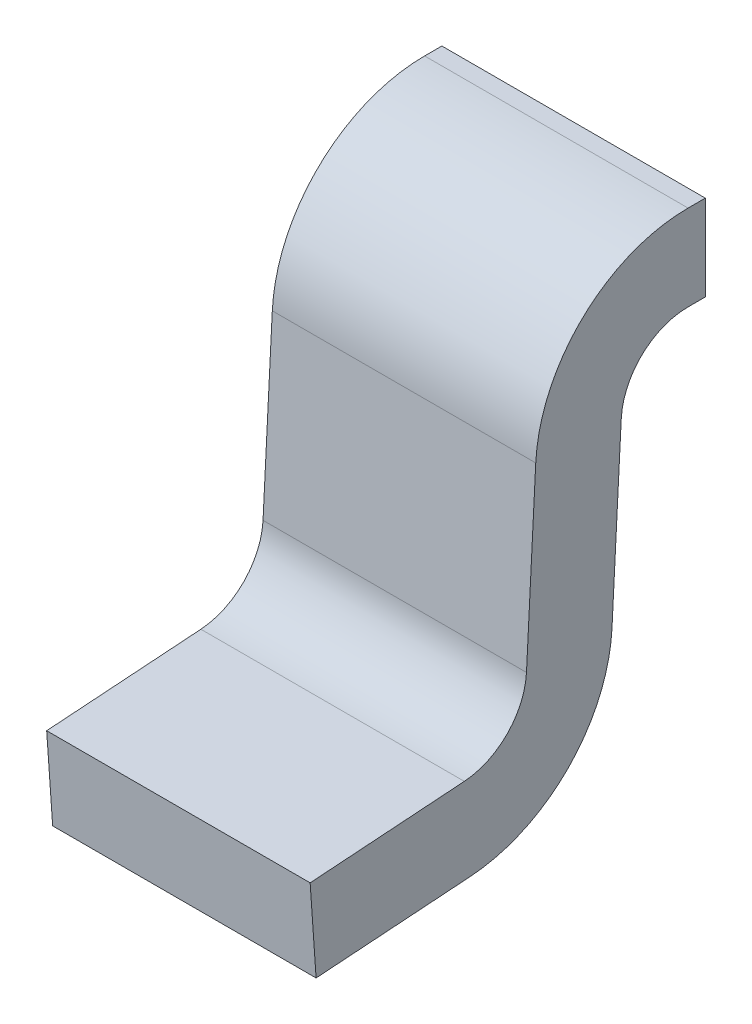
ISO-10303-21;
HEADER;
FILE_DESCRIPTION(('STEP AP214'),'2;1');
FILE_NAME('part.step','',(''),(''),'','','');
FILE_SCHEMA(('AUTOMOTIVE_DESIGN { 1 0 10303 214 1 1 1 1 }'));
ENDSEC;
DATA;
#1=APPLICATION_CONTEXT('core data for automotive mechanical design processes');
#2=APPLICATION_PROTOCOL_DEFINITION('international standard','automotive_design',2000,#1);
#3=PRODUCT_CONTEXT('',#1,'mechanical');
#4=PRODUCT('Part','Part','',(#3));
#5=PRODUCT_RELATED_PRODUCT_CATEGORY('part','',(#4));
#6=PRODUCT_DEFINITION_FORMATION('','',#4);
#7=PRODUCT_DEFINITION_CONTEXT('part definition',#1,'design');
#8=PRODUCT_DEFINITION('design','',#6,#7);
#9=PRODUCT_DEFINITION_SHAPE('','',#8);
#10=(LENGTH_UNIT() NAMED_UNIT(*) SI_UNIT(.MILLI.,.METRE.));
#11=(NAMED_UNIT(*) PLANE_ANGLE_UNIT() SI_UNIT($,.RADIAN.));
#12=(NAMED_UNIT(*) SI_UNIT($,.STERADIAN.) SOLID_ANGLE_UNIT());
#13=UNCERTAINTY_MEASURE_WITH_UNIT(LENGTH_MEASURE(1.E-05),#10,'distance_accuracy_value','');
#14=(GEOMETRIC_REPRESENTATION_CONTEXT(3) GLOBAL_UNCERTAINTY_ASSIGNED_CONTEXT((#13)) GLOBAL_UNIT_ASSIGNED_CONTEXT((#10,
#11,#12)) REPRESENTATION_CONTEXT('',''));
#15=CARTESIAN_POINT('',(0.,0.,0.));
#16=DIRECTION('',(0.,0.,1.));
#17=DIRECTION('',(1.,0.,0.));
#18=AXIS2_PLACEMENT_3D('',#15,#16,#17);
#19=CARTESIAN_POINT('',(-0.2,-0.219336739934,0.01149495145513));
#20=DIRECTION('',(0.,-0.0523359562429177,-0.998629534754575));
#21=DIRECTION('',(0.,0.998629534754575,-0.0523359562429177));
#22=AXIS2_PLACEMENT_3D('',#19,#20,#21);
#23=PLANE('',#22);
#24=DIRECTION('',(1.,0.,0.));
#25=VECTOR('',#24,1.);
#26=CARTESIAN_POINT('',(-0.2,0.253717333154016,-0.0132967619959213));
#27=LINE('',#26,#25);
#28=CARTESIAN_POINT('',(-0.2,0.253717333154144,-0.0132967619960828));
#29=VERTEX_POINT('',#28);
#30=CARTESIAN_POINT('',(0.2,0.253717333154144,-0.0132967619960828));
#31=VERTEX_POINT('',#30);
#32=EDGE_CURVE('E157',#29,#31,#27,.T.);
#33=ORIENTED_EDGE('',*,*,#32,.T.);
#34=DIRECTION('',(0.,0.998629534754571,-0.0523359562429933));
#35=VECTOR('',#34,1.);
#36=CARTESIAN_POINT('',(0.2,-0.0147151802415,0.0007711899182067));
#37=LINE('',#36,#35);
#38=CARTESIAN_POINT('',(0.2,-0.0147151802415051,0.000771189918023985));
#39=VERTEX_POINT('',#38);
#40=EDGE_CURVE('E181',#39,#31,#37,.T.);
#41=ORIENTED_EDGE('',*,*,#40,.F.);
#42=DIRECTION('',(-1.,0.,0.));
#43=VECTOR('',#42,1.);
#44=CARTESIAN_POINT('',(-0.2,-0.0147151802415191,0.000771189917841758));
#45=LINE('',#44,#43);
#46=CARTESIAN_POINT('',(-0.2,-0.0147151802415051,0.000771189918023985));
#47=VERTEX_POINT('',#46);
#48=EDGE_CURVE('E116',#47,#39,#45,.F.);
#49=ORIENTED_EDGE('',*,*,#48,.F.);
#50=DIRECTION('',(0.,0.998629534754571,-0.0523359562429933));
#51=VECTOR('',#50,1.);
#52=CARTESIAN_POINT('',(-0.2,-0.0147151802415,0.0007711899182067));
#53=LINE('',#52,#51);
#54=EDGE_CURVE('E139',#47,#29,#53,.T.);
#55=ORIENTED_EDGE('',*,*,#54,.T.);
#56=EDGE_LOOP('',(#33,#41,#49,#55));
#57=FACE_BOUND('',#56,.T.);
#58=ADVANCED_FACE('F17',(#57),#23,.T.);
#59=CARTESIAN_POINT('',(-0.2,0.2484,-0.114757522727));
#60=DIRECTION('',(1.,0.,0.));
#61=DIRECTION('',(0.,0.,-1.));
#62=AXIS2_PLACEMENT_3D('',#59,#60,#61);
#63=CYLINDRICAL_SURFACE('',#62,0.1016);
#64=ORIENTED_EDGE('',*,*,#32,.F.);
#65=CARTESIAN_POINT('',(-0.2,0.2484,-0.114757522727));
#66=DIRECTION('',(1.,0.,0.));
#67=DIRECTION('',(0.,0.,-1.));
#68=AXIS2_PLACEMENT_3D('',#65,#66,#67);
#69=CIRCLE('',#68,0.1016);
#70=CARTESIAN_POINT('',(-0.2,0.35,-0.114757522727));
#71=VERTEX_POINT('',#70);
#72=EDGE_CURVE('E177',#29,#71,#69,.F.);
#73=ORIENTED_EDGE('',*,*,#72,.T.);
#74=DIRECTION('',(1.,0.,0.));
#75=VECTOR('',#74,1.);
#76=CARTESIAN_POINT('',(-0.2,0.35,-0.114757522727));
#77=LINE('',#76,#75);
#78=CARTESIAN_POINT('',(0.2,0.35,-0.114757522727));
#79=VERTEX_POINT('',#78);
#80=EDGE_CURVE('E152',#79,#71,#77,.F.);
#81=ORIENTED_EDGE('',*,*,#80,.F.);
#82=CARTESIAN_POINT('',(0.2,0.2484,-0.114757522727));
#83=DIRECTION('',(1.,0.,0.));
#84=DIRECTION('',(0.,0.,-1.));
#85=AXIS2_PLACEMENT_3D('',#82,#83,#84);
#86=CIRCLE('',#85,0.1016);
#87=EDGE_CURVE('E179',#31,#79,#86,.F.);
#88=ORIENTED_EDGE('',*,*,#87,.F.);
#89=EDGE_LOOP('',(#64,#73,#81,#88));
#90=FACE_BOUND('',#89,.T.);
#91=ADVANCED_FACE('F222',(#90),#63,.F.);
#92=CARTESIAN_POINT('',(-0.2,0.35,-0.01834272274906));
#93=DIRECTION('',(0.,-1.,0.));
#94=DIRECTION('',(0.,0.,-1.));
#95=AXIS2_PLACEMENT_3D('',#92,#93,#94);
#96=PLANE('',#95);
#97=ORIENTED_EDGE('',*,*,#80,.T.);
#98=DIRECTION('',(0.,0.,-1.));
#99=VECTOR('',#98,1.);
#100=CARTESIAN_POINT('',(-0.2,0.35,0.));
#101=LINE('',#100,#99);
#102=CARTESIAN_POINT('',(-0.2,0.35,-0.140931658413));
#103=VERTEX_POINT('',#102);
#104=EDGE_CURVE('E147',#71,#103,#101,.T.);
#105=ORIENTED_EDGE('',*,*,#104,.T.);
#106=DIRECTION('',(-1.,0.,0.));
#107=VECTOR('',#106,1.);
#108=CARTESIAN_POINT('',(-0.2,0.35,-0.140931658413));
#109=LINE('',#108,#107);
#110=CARTESIAN_POINT('',(0.2,0.35,-0.140931658413));
#111=VERTEX_POINT('',#110);
#112=EDGE_CURVE('E132',#111,#103,#109,.T.);
#113=ORIENTED_EDGE('',*,*,#112,.F.);
#114=DIRECTION('',(0.,0.,-1.));
#115=VECTOR('',#114,1.);
#116=CARTESIAN_POINT('',(0.2,0.35,0.));
#117=LINE('',#116,#115);
#118=EDGE_CURVE('E162',#79,#111,#117,.T.);
#119=ORIENTED_EDGE('',*,*,#118,.F.);
#120=EDGE_LOOP('',(#97,#105,#113,#119));
#121=FACE_BOUND('',#120,.T.);
#122=ADVANCED_FACE('F228',(#121),#96,.T.);
#123=CARTESIAN_POINT('',(-0.2,0.35,-0.140931658413));
#124=DIRECTION('',(0.,0.,-1.));
#125=DIRECTION('',(-1.,0.,0.));
#126=AXIS2_PLACEMENT_3D('',#123,#124,#125);
#127=PLANE('',#126);
#128=ORIENTED_EDGE('',*,*,#112,.T.);
#129=DIRECTION('',(0.,1.,0.));
#130=VECTOR('',#129,1.);
#131=CARTESIAN_POINT('',(-0.2,0.,-0.140931658413));
#132=LINE('',#131,#130);
#133=CARTESIAN_POINT('',(-0.2,0.48,-0.140931658413));
#134=VERTEX_POINT('',#133);
#135=EDGE_CURVE('E143',#103,#134,#132,.T.);
#136=ORIENTED_EDGE('',*,*,#135,.T.);
#137=DIRECTION('',(1.,0.,0.));
#138=VECTOR('',#137,1.);
#139=CARTESIAN_POINT('',(-0.2,0.48,-0.140931658413));
#140=LINE('',#139,#138);
#141=CARTESIAN_POINT('',(0.2,0.48,-0.140931658413));
#142=VERTEX_POINT('',#141);
#143=EDGE_CURVE('E136',#142,#134,#140,.F.);
#144=ORIENTED_EDGE('',*,*,#143,.F.);
#145=DIRECTION('',(0.,1.,0.));
#146=VECTOR('',#145,1.);
#147=CARTESIAN_POINT('',(0.2,0.,-0.140931658413));
#148=LINE('',#147,#146);
#149=EDGE_CURVE('E159',#111,#142,#148,.T.);
#150=ORIENTED_EDGE('',*,*,#149,.F.);
#151=EDGE_LOOP('',(#128,#136,#144,#150));
#152=FACE_BOUND('',#151,.T.);
#153=ADVANCED_FACE('F285',(#152),#127,.T.);
#154=CARTESIAN_POINT('',(-0.2,-0.09767640430975,0.135297408418));
#155=DIRECTION('',(0.,0.997564050259825,0.0697564737441177));
#156=DIRECTION('',(0.,-0.0697564737441177,0.997564050259825));
#157=AXIS2_PLACEMENT_3D('',#154,#155,#156);
#158=PLANE('',#157);
#159=DIRECTION('',(1.,0.,0.));
#160=VECTOR('',#159,1.);
#161=CARTESIAN_POINT('',(-0.2,-0.103946680282059,0.224966532434996));
#162=LINE('',#161,#160);
#163=CARTESIAN_POINT('',(0.2,-0.103946680282019,0.224966532434843));
#164=VERTEX_POINT('',#163);
#165=CARTESIAN_POINT('',(-0.2,-0.103946680282019,0.224966532434843));
#166=VERTEX_POINT('',#165);
#167=EDGE_CURVE('E93',#164,#166,#162,.F.);
#168=ORIENTED_EDGE('',*,*,#167,.T.);
#169=DIRECTION('',(0.,-0.0697564737432455,0.997564050259886));
#170=VECTOR('',#169,1.);
#171=CARTESIAN_POINT('',(-0.2,-0.103946680282,0.224966532435));
#172=LINE('',#171,#170);
#173=CARTESIAN_POINT('',(-0.2,-0.120316673466,0.459068341587));
#174=VERTEX_POINT('',#173);
#175=EDGE_CURVE('E127',#166,#174,#172,.T.);
#176=ORIENTED_EDGE('',*,*,#175,.T.);
#177=DIRECTION('',(1.,0.,0.));
#178=VECTOR('',#177,1.);
#179=CARTESIAN_POINT('',(-0.2,-0.120316673466,0.459068341587));
#180=LINE('',#179,#178);
#181=CARTESIAN_POINT('',(0.2,-0.120316673466,0.459068341587));
#182=VERTEX_POINT('',#181);
#183=EDGE_CURVE('E121',#182,#174,#180,.F.);
#184=ORIENTED_EDGE('',*,*,#183,.F.);
#185=DIRECTION('',(0.,-0.0697564737432455,0.997564050259886));
#186=VECTOR('',#185,1.);
#187=CARTESIAN_POINT('',(0.2,-0.103946680282,0.224966532435));
#188=LINE('',#187,#186);
#189=EDGE_CURVE('E97',#164,#182,#188,.T.);
#190=ORIENTED_EDGE('',*,*,#189,.F.);
#191=EDGE_LOOP('',(#168,#176,#184,#190));
#192=FACE_BOUND('',#191,.T.);
#193=ADVANCED_FACE('F200',(#192),#158,.T.);
#194=CARTESIAN_POINT('',(-0.2,-0.120316673466,0.459068341587));
#195=DIRECTION('',(0.,-0.0697564737441177,0.997564050259825));
#196=DIRECTION('',(0.,-0.997564050259825,-0.0697564737441177));
#197=AXIS2_PLACEMENT_3D('',#194,#195,#196);
#198=PLANE('',#197);
#199=ORIENTED_EDGE('',*,*,#183,.T.);
#200=DIRECTION('',(0.,-0.997564050259692,-0.0697564737460242));
#201=VECTOR('',#200,1.);
#202=CARTESIAN_POINT('',(-0.2,-0.120316673466,0.459068341587));
#203=LINE('',#202,#201);
#204=CARTESIAN_POINT('',(-0.2,-0.25,0.45));
#205=VERTEX_POINT('',#204);
#206=EDGE_CURVE('E124',#174,#205,#203,.T.);
#207=ORIENTED_EDGE('',*,*,#206,.T.);
#208=DIRECTION('',(1.,0.,0.));
#209=VECTOR('',#208,1.);
#210=CARTESIAN_POINT('',(-0.2,-0.25,0.45));
#211=LINE('',#210,#209);
#212=CARTESIAN_POINT('',(0.2,-0.25,0.45));
#213=VERTEX_POINT('',#212);
#214=EDGE_CURVE('E117',#213,#205,#211,.F.);
#215=ORIENTED_EDGE('',*,*,#214,.F.);
#216=DIRECTION('',(0.,-0.997564050259692,-0.0697564737460242));
#217=VECTOR('',#216,1.);
#218=CARTESIAN_POINT('',(0.2,-0.120316673466,0.459068341587));
#219=LINE('',#218,#217);
#220=EDGE_CURVE('E165',#182,#213,#219,.T.);
#221=ORIENTED_EDGE('',*,*,#220,.F.);
#222=EDGE_LOOP('',(#199,#207,#215,#221));
#223=FACE_BOUND('',#222,.T.);
#224=ADVANCED_FACE('F206',(#223),#198,.T.);
#225=CARTESIAN_POINT('',(-0.2,-0.25,0.45));
#226=DIRECTION('',(0.,-0.997564050259825,-0.0697564737441177));
#227=DIRECTION('',(0.,0.0697564737441177,-0.997564050259825));
#228=AXIS2_PLACEMENT_3D('',#225,#226,#227);
#229=PLANE('',#228);
#230=ORIENTED_EDGE('',*,*,#214,.T.);
#231=DIRECTION('',(0.,0.0697564737432456,-0.997564050259886));
#232=VECTOR('',#231,1.);
#233=CARTESIAN_POINT('',(-0.2,-0.25,0.45));
#234=LINE('',#233,#232);
#235=CARTESIAN_POINT('',(-0.2,-0.233630006815911,0.215898190848032));
#236=VERTEX_POINT('',#235);
#237=EDGE_CURVE('E109',#205,#236,#234,.T.);
#238=ORIENTED_EDGE('',*,*,#237,.T.);
#239=DIRECTION('',(-1.,0.,0.));
#240=VECTOR('',#239,1.);
#241=CARTESIAN_POINT('',(-0.2,-0.233630006815819,0.215898190848013));
#242=LINE('',#241,#240);
#243=CARTESIAN_POINT('',(0.2,-0.233630006815911,0.215898190848032));
#244=VERTEX_POINT('',#243);
#245=EDGE_CURVE('E113',#244,#236,#242,.T.);
#246=ORIENTED_EDGE('',*,*,#245,.F.);
#247=DIRECTION('',(0.,0.0697564737432456,-0.997564050259886));
#248=VECTOR('',#247,1.);
#249=CARTESIAN_POINT('',(0.2,-0.25,0.45));
#250=LINE('',#249,#248);
#251=EDGE_CURVE('E168',#213,#244,#250,.T.);
#252=ORIENTED_EDGE('',*,*,#251,.F.);
#253=EDGE_LOOP('',(#230,#238,#246,#252));
#254=FACE_BOUND('',#253,.T.);
#255=ADVANCED_FACE('F210',(#254),#229,.T.);
#256=CARTESIAN_POINT('',(-0.2,-0.002594172775633,0.232053790167));
#257=DIRECTION('',(-1.,0.,0.));
#258=DIRECTION('',(0.,0.,1.));
#259=AXIS2_PLACEMENT_3D('',#256,#257,#258);
#260=CYLINDRICAL_SURFACE('',#259,0.2316);
#261=CARTESIAN_POINT('',(-0.2,-0.002594172775633,0.232053790167));
#262=DIRECTION('',(-1.,0.,0.));
#263=DIRECTION('',(0.,0.,1.));
#264=AXIS2_PLACEMENT_3D('',#261,#262,#263);
#265=CIRCLE('',#264,0.2316);
#266=EDGE_CURVE('E106',#236,#47,#265,.F.);
#267=ORIENTED_EDGE('',*,*,#266,.T.);
#268=ORIENTED_EDGE('',*,*,#48,.T.);
#269=CARTESIAN_POINT('',(0.2,-0.002594172775633,0.232053790167));
#270=DIRECTION('',(-1.,0.,0.));
#271=DIRECTION('',(0.,0.,1.));
#272=AXIS2_PLACEMENT_3D('',#269,#270,#271);
#273=CIRCLE('',#272,0.2316);
#274=EDGE_CURVE('E182',#244,#39,#273,.F.);
#275=ORIENTED_EDGE('',*,*,#274,.F.);
#276=ORIENTED_EDGE('',*,*,#245,.T.);
#277=EDGE_LOOP('',(#267,#268,#275,#276));
#278=FACE_BOUND('',#277,.T.);
#279=ADVANCED_FACE('F213',(#278),#260,.T.);
#280=CARTESIAN_POINT('',(-0.2,-0.002594172775633,0.232053790167));
#281=DIRECTION('',(1.,0.,0.));
#282=DIRECTION('',(0.,0.,-1.));
#283=AXIS2_PLACEMENT_3D('',#280,#281,#282);
#284=CYLINDRICAL_SURFACE('',#283,0.1016);
#285=DIRECTION('',(1.,0.,0.));
#286=VECTOR('',#285,1.);
#287=CARTESIAN_POINT('',(-0.2,-0.00791150592990522,0.130593029436206));
#288=LINE('',#287,#286);
#289=CARTESIAN_POINT('',(-0.2,-0.00791150592990225,0.130593029436206));
#290=VERTEX_POINT('',#289);
#291=CARTESIAN_POINT('',(0.2,-0.00791150592990225,0.130593029436206));
#292=VERTEX_POINT('',#291);
#293=EDGE_CURVE('E92',#290,#292,#288,.T.);
#294=ORIENTED_EDGE('',*,*,#293,.F.);
#295=CARTESIAN_POINT('',(-0.2,-0.002594172775633,0.232053790167));
#296=DIRECTION('',(1.,0.,0.));
#297=DIRECTION('',(0.,0.,-1.));
#298=AXIS2_PLACEMENT_3D('',#295,#296,#297);
#299=CIRCLE('',#298,0.1016);
#300=EDGE_CURVE('E175',#290,#166,#299,.F.);
#301=ORIENTED_EDGE('',*,*,#300,.T.);
#302=ORIENTED_EDGE('',*,*,#167,.F.);
#303=CARTESIAN_POINT('',(0.2,-0.002594172775633,0.232053790167));
#304=DIRECTION('',(1.,0.,0.));
#305=DIRECTION('',(0.,0.,-1.));
#306=AXIS2_PLACEMENT_3D('',#303,#304,#305);
#307=CIRCLE('',#306,0.1016);
#308=EDGE_CURVE('E20',#292,#164,#307,.F.);
#309=ORIENTED_EDGE('',*,*,#308,.F.);
#310=EDGE_LOOP('',(#294,#301,#302,#309));
#311=FACE_BOUND('',#310,.T.);
#312=ADVANCED_FACE('F89',(#311),#284,.F.);
#313=CARTESIAN_POINT('',(0.2,0.,0.));
#314=DIRECTION('',(1.,0.,0.));
#315=DIRECTION('',(0.,0.,-1.));
#316=AXIS2_PLACEMENT_3D('',#313,#314,#315);
#317=PLANE('',#316);
#318=CARTESIAN_POINT('',(0.2,0.2484,-0.114757522727));
#319=DIRECTION('',(-1.,0.,0.));
#320=DIRECTION('',(0.,0.,1.));
#321=AXIS2_PLACEMENT_3D('',#318,#319,#320);
#322=CIRCLE('',#321,0.2316);
#323=CARTESIAN_POINT('',(0.2,0.260521007465924,0.116525077521964));
#324=VERTEX_POINT('',#323);
#325=CARTESIAN_POINT('',(0.2,0.48,-0.114757522727));
#326=VERTEX_POINT('',#325);
#327=EDGE_CURVE('E102',#324,#326,#322,.T.);
#328=ORIENTED_EDGE('',*,*,#327,.F.);
#329=DIRECTION('',(0.,-0.998629534754575,0.0523359562429177));
#330=VECTOR('',#329,1.);
#331=CARTESIAN_POINT('',(0.2,0.006803674311583,0.129821839518));
#332=LINE('',#331,#330);
#333=EDGE_CURVE('E99',#292,#324,#332,.F.);
#334=ORIENTED_EDGE('',*,*,#333,.F.);
#335=ORIENTED_EDGE('',*,*,#308,.T.);
#336=ORIENTED_EDGE('',*,*,#189,.T.);
#337=ORIENTED_EDGE('',*,*,#220,.T.);
#338=ORIENTED_EDGE('',*,*,#251,.T.);
#339=ORIENTED_EDGE('',*,*,#274,.T.);
#340=ORIENTED_EDGE('',*,*,#40,.T.);
#341=ORIENTED_EDGE('',*,*,#87,.T.);
#342=ORIENTED_EDGE('',*,*,#118,.T.);
#343=ORIENTED_EDGE('',*,*,#149,.T.);
#344=DIRECTION('',(0.,0.,1.));
#345=VECTOR('',#344,1.);
#346=CARTESIAN_POINT('',(0.2,0.48,-0.140931658413));
#347=LINE('',#346,#345);
#348=EDGE_CURVE('E140',#326,#142,#347,.F.);
#349=ORIENTED_EDGE('',*,*,#348,.F.);
#350=EDGE_LOOP('',(#328,#334,#335,#336,#337,#338,#339,#340,#341,#342,#343,#349));
#351=FACE_BOUND('',#350,.T.);
#352=ADVANCED_FACE('F100',(#351),#317,.T.);
#353=CARTESIAN_POINT('',(-0.2,0.48,-0.140931658413));
#354=DIRECTION('',(0.,1.,0.));
#355=DIRECTION('',(0.,0.,1.));
#356=AXIS2_PLACEMENT_3D('',#353,#354,#355);
#357=PLANE('',#356);
#358=ORIENTED_EDGE('',*,*,#143,.T.);
#359=DIRECTION('',(0.,0.,-1.));
#360=VECTOR('',#359,1.);
#361=CARTESIAN_POINT('',(-0.2,0.48,0.));
#362=LINE('',#361,#360);
#363=CARTESIAN_POINT('',(-0.2,0.48,-0.114757522727));
#364=VERTEX_POINT('',#363);
#365=EDGE_CURVE('E146',#134,#364,#362,.F.);
#366=ORIENTED_EDGE('',*,*,#365,.T.);
#367=DIRECTION('',(-1.,0.,0.));
#368=VECTOR('',#367,1.);
#369=CARTESIAN_POINT('',(-0.2,0.48,-0.114757522727));
#370=LINE('',#369,#368);
#371=EDGE_CURVE('E173',#326,#364,#370,.T.);
#372=ORIENTED_EDGE('',*,*,#371,.F.);
#373=ORIENTED_EDGE('',*,*,#348,.T.);
#374=EDGE_LOOP('',(#358,#366,#372,#373));
#375=FACE_BOUND('',#374,.T.);
#376=ADVANCED_FACE('F255',(#375),#357,.T.);
#377=CARTESIAN_POINT('',(-0.2,0.,0.));
#378=DIRECTION('',(1.,0.,0.));
#379=DIRECTION('',(0.,0.,-1.));
#380=AXIS2_PLACEMENT_3D('',#377,#378,#379);
#381=PLANE('',#380);
#382=ORIENTED_EDGE('',*,*,#237,.F.);
#383=ORIENTED_EDGE('',*,*,#206,.F.);
#384=ORIENTED_EDGE('',*,*,#175,.F.);
#385=ORIENTED_EDGE('',*,*,#300,.F.);
#386=DIRECTION('',(0.,-0.998629534754575,0.0523359562429177));
#387=VECTOR('',#386,1.);
#388=CARTESIAN_POINT('',(-0.2,0.006803674311583,0.129821839518));
#389=LINE('',#388,#387);
#390=CARTESIAN_POINT('',(-0.2,0.260521007465924,0.116525077521964));
#391=VERTEX_POINT('',#390);
#392=EDGE_CURVE('E35',#391,#290,#389,.T.);
#393=ORIENTED_EDGE('',*,*,#392,.F.);
#394=CARTESIAN_POINT('',(-0.2,0.2484,-0.114757522727));
#395=DIRECTION('',(-1.,0.,0.));
#396=DIRECTION('',(0.,0.,1.));
#397=AXIS2_PLACEMENT_3D('',#394,#395,#396);
#398=CIRCLE('',#397,0.2316);
#399=EDGE_CURVE('E26',#364,#391,#398,.F.);
#400=ORIENTED_EDGE('',*,*,#399,.F.);
#401=ORIENTED_EDGE('',*,*,#365,.F.);
#402=ORIENTED_EDGE('',*,*,#135,.F.);
#403=ORIENTED_EDGE('',*,*,#104,.F.);
#404=ORIENTED_EDGE('',*,*,#72,.F.);
#405=ORIENTED_EDGE('',*,*,#54,.F.);
#406=ORIENTED_EDGE('',*,*,#266,.F.);
#407=EDGE_LOOP('',(#382,#383,#384,#385,#393,#400,#401,#402,#403,#404,#405,#406));
#408=FACE_BOUND('',#407,.T.);
#409=ADVANCED_FACE('F258',(#408),#381,.F.);
#410=CARTESIAN_POINT('',(-0.2,0.006803674311583,0.129821839518));
#411=DIRECTION('',(0.,0.0523359562429177,0.998629534754575));
#412=DIRECTION('',(0.,-0.998629534754575,0.0523359562429177));
#413=AXIS2_PLACEMENT_3D('',#410,#411,#412);
#414=PLANE('',#413);
#415=DIRECTION('',(-1.,0.,0.));
#416=VECTOR('',#415,1.);
#417=CARTESIAN_POINT('',(-0.2,0.260521007466008,0.116525077522152));
#418=LINE('',#417,#416);
#419=EDGE_CURVE('E11',#391,#324,#418,.F.);
#420=ORIENTED_EDGE('',*,*,#419,.F.);
#421=ORIENTED_EDGE('',*,*,#392,.T.);
#422=ORIENTED_EDGE('',*,*,#293,.T.);
#423=ORIENTED_EDGE('',*,*,#333,.T.);
#424=EDGE_LOOP('',(#420,#421,#422,#423));
#425=FACE_BOUND('',#424,.T.);
#426=ADVANCED_FACE('F105',(#425),#414,.T.);
#427=CARTESIAN_POINT('',(-0.2,0.2484,-0.114757522727));
#428=DIRECTION('',(-1.,0.,0.));
#429=DIRECTION('',(0.,0.,1.));
#430=AXIS2_PLACEMENT_3D('',#427,#428,#429);
#431=CYLINDRICAL_SURFACE('',#430,0.2316);
#432=ORIENTED_EDGE('',*,*,#399,.T.);
#433=ORIENTED_EDGE('',*,*,#419,.T.);
#434=ORIENTED_EDGE('',*,*,#327,.T.);
#435=ORIENTED_EDGE('',*,*,#371,.T.);
#436=EDGE_LOOP('',(#432,#433,#434,#435));
#437=FACE_BOUND('',#436,.T.);
#438=ADVANCED_FACE('F260',(#437),#431,.T.);
#439=CLOSED_SHELL('',(#58,#91,#122,#153,#193,#224,#255,#279,#312,#352,#376,#409,#426,#438));
#440=MANIFOLD_SOLID_BREP('B1',#439);
#441=ADVANCED_BREP_SHAPE_REPRESENTATION('',(#18,#440),#14);
#442=SHAPE_DEFINITION_REPRESENTATION(#9,#441);
ENDSEC;
END-ISO-10303-21;
